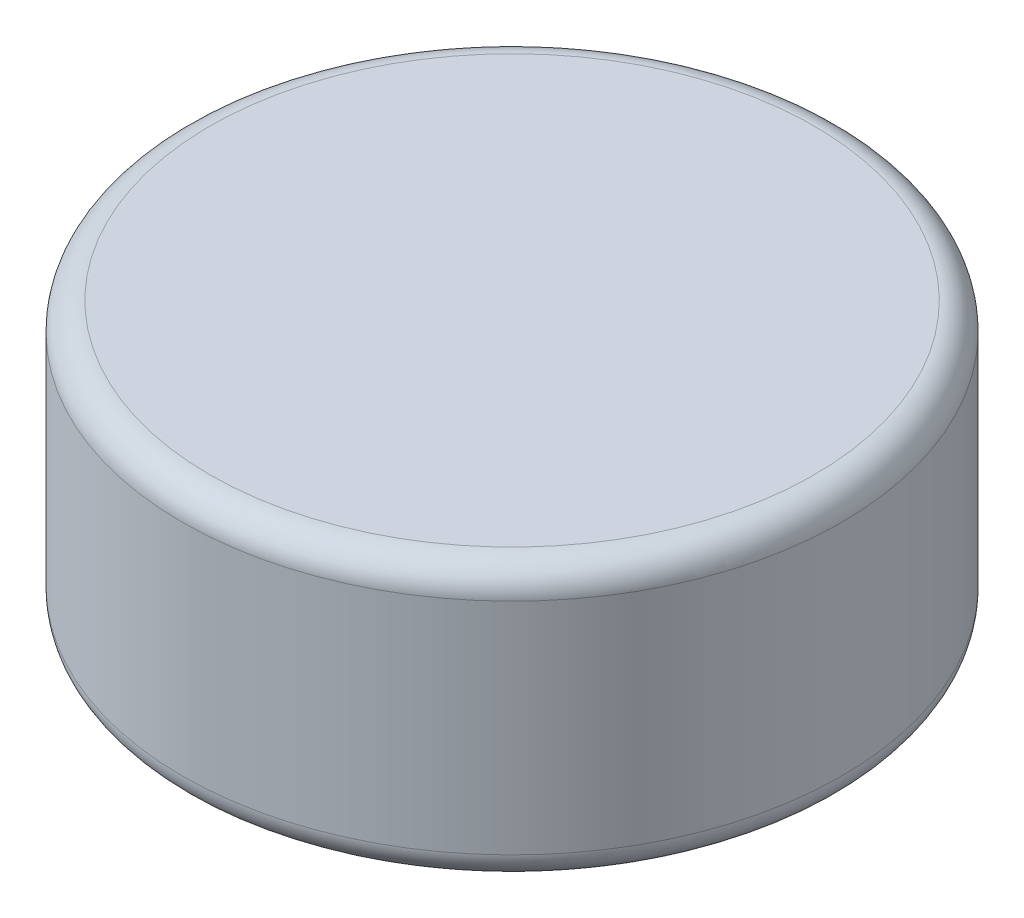
ISO-10303-21;
HEADER;
FILE_DESCRIPTION(('STEP AP214'),'2;1');
FILE_NAME('part.step','',(''),(''),'','','');
FILE_SCHEMA(('AUTOMOTIVE_DESIGN { 1 0 10303 214 1 1 1 1 }'));
ENDSEC;
DATA;
#1=APPLICATION_CONTEXT('core data for automotive mechanical design processes');
#2=APPLICATION_PROTOCOL_DEFINITION('international standard','automotive_design',2000,#1);
#3=PRODUCT_CONTEXT('',#1,'mechanical');
#4=PRODUCT('Part','Part','',(#3));
#5=PRODUCT_RELATED_PRODUCT_CATEGORY('part','',(#4));
#6=PRODUCT_DEFINITION_FORMATION('','',#4);
#7=PRODUCT_DEFINITION_CONTEXT('part definition',#1,'design');
#8=PRODUCT_DEFINITION('design','',#6,#7);
#9=PRODUCT_DEFINITION_SHAPE('','',#8);
#10=(LENGTH_UNIT() NAMED_UNIT(*) SI_UNIT(.MILLI.,.METRE.));
#11=(NAMED_UNIT(*) PLANE_ANGLE_UNIT() SI_UNIT($,.RADIAN.));
#12=(NAMED_UNIT(*) SI_UNIT($,.STERADIAN.) SOLID_ANGLE_UNIT());
#13=UNCERTAINTY_MEASURE_WITH_UNIT(LENGTH_MEASURE(1.E-05),#10,'distance_accuracy_value','');
#14=(GEOMETRIC_REPRESENTATION_CONTEXT(3) GLOBAL_UNCERTAINTY_ASSIGNED_CONTEXT((#13)) GLOBAL_UNIT_ASSIGNED_CONTEXT((#10,
#11,#12)) REPRESENTATION_CONTEXT('',''));
#15=CARTESIAN_POINT('',(0.,0.,0.));
#16=DIRECTION('',(0.,0.,1.));
#17=DIRECTION('',(1.,0.,0.));
#18=AXIS2_PLACEMENT_3D('',#15,#16,#17);
#19=CARTESIAN_POINT('',(0.,1.25,0.));
#20=DIRECTION('',(0.,-1.,0.));
#21=DIRECTION('',(0.,0.,-1.));
#22=AXIS2_PLACEMENT_3D('',#19,#20,#21);
#23=CYLINDRICAL_SURFACE('',#22,3.);
#24=CARTESIAN_POINT('',(0.,-1.,0.));
#25=DIRECTION('',(0.,1.,0.));
#26=DIRECTION('',(0.,0.,1.));
#27=AXIS2_PLACEMENT_3D('',#24,#25,#26);
#28=CIRCLE('',#27,3.);
#29=CARTESIAN_POINT('',(0.,-1.,3.));
#30=VERTEX_POINT('',#29);
#31=EDGE_CURVE('E45',#30,#30,#28,.T.);
#32=ORIENTED_EDGE('',*,*,#31,.T.);
#33=EDGE_LOOP('',(#32));
#34=FACE_BOUND('',#33,.T.);
#35=CARTESIAN_POINT('',(0.,1.,0.));
#36=DIRECTION('',(0.,1.,0.));
#37=DIRECTION('',(0.,0.,1.));
#38=AXIS2_PLACEMENT_3D('',#35,#36,#37);
#39=CIRCLE('',#38,3.);
#40=CARTESIAN_POINT('',(0.,1.,3.));
#41=VERTEX_POINT('',#40);
#42=EDGE_CURVE('E49',#41,#41,#39,.F.);
#43=ORIENTED_EDGE('',*,*,#42,.T.);
#44=EDGE_LOOP('',(#43));
#45=FACE_BOUND('',#44,.T.);
#46=ADVANCED_FACE('F34',(#34,#45),#23,.T.);
#47=CARTESIAN_POINT('',(0.,1.25,0.));
#48=DIRECTION('',(0.,1.,0.));
#49=DIRECTION('',(0.,0.,1.));
#50=AXIS2_PLACEMENT_3D('',#47,#48,#49);
#51=PLANE('',#50);
#52=CARTESIAN_POINT('',(0.,1.25,0.));
#53=DIRECTION('',(0.,1.,0.));
#54=DIRECTION('',(0.,0.,1.));
#55=AXIS2_PLACEMENT_3D('',#52,#53,#54);
#56=CIRCLE('',#55,2.75);
#57=CARTESIAN_POINT('',(0.,1.25,2.75));
#58=VERTEX_POINT('',#57);
#59=EDGE_CURVE('E10',#58,#58,#56,.T.);
#60=ORIENTED_EDGE('',*,*,#59,.T.);
#61=EDGE_LOOP('',(#60));
#62=FACE_BOUND('',#61,.T.);
#63=ADVANCED_FACE('F65',(#62),#51,.T.);
#64=CARTESIAN_POINT('',(0.,-1.25,0.));
#65=DIRECTION('',(0.,1.,0.));
#66=DIRECTION('',(0.,0.,1.));
#67=AXIS2_PLACEMENT_3D('',#64,#65,#66);
#68=PLANE('',#67);
#69=CARTESIAN_POINT('',(0.,-1.25,0.));
#70=DIRECTION('',(0.,1.,0.));
#71=DIRECTION('',(0.,0.,1.));
#72=AXIS2_PLACEMENT_3D('',#69,#70,#71);
#73=CIRCLE('',#72,2.75);
#74=CARTESIAN_POINT('',(0.,-1.25,2.75));
#75=VERTEX_POINT('',#74);
#76=EDGE_CURVE('E41',#75,#75,#73,.F.);
#77=ORIENTED_EDGE('',*,*,#76,.T.);
#78=EDGE_LOOP('',(#77));
#79=FACE_BOUND('',#78,.T.);
#80=ADVANCED_FACE('F62',(#79),#68,.F.);
#81=CARTESIAN_POINT('',(0.,-1.,0.));
#82=DIRECTION('',(0.,1.,0.));
#83=DIRECTION('',(0.,0.,1.));
#84=AXIS2_PLACEMENT_3D('',#81,#82,#83);
#85=TOROIDAL_SURFACE('',#84,2.75,0.25);
#86=ORIENTED_EDGE('',*,*,#76,.F.);
#87=EDGE_LOOP('',(#86));
#88=FACE_BOUND('',#87,.T.);
#89=ORIENTED_EDGE('',*,*,#31,.F.);
#90=EDGE_LOOP('',(#89));
#91=FACE_BOUND('',#90,.T.);
#92=ADVANCED_FACE('F58',(#88,#91),#85,.T.);
#93=CARTESIAN_POINT('',(0.,1.,0.));
#94=DIRECTION('',(0.,1.,0.));
#95=DIRECTION('',(0.,0.,1.));
#96=AXIS2_PLACEMENT_3D('',#93,#94,#95);
#97=TOROIDAL_SURFACE('',#96,2.75,0.25);
#98=ORIENTED_EDGE('',*,*,#42,.F.);
#99=EDGE_LOOP('',(#98));
#100=FACE_BOUND('',#99,.T.);
#101=ORIENTED_EDGE('',*,*,#59,.F.);
#102=EDGE_LOOP('',(#101));
#103=FACE_BOUND('',#102,.T.);
#104=ADVANCED_FACE('F36',(#100,#103),#97,.T.);
#105=CLOSED_SHELL('',(#46,#63,#80,#92,#104));
#106=MANIFOLD_SOLID_BREP('B2',#105);
#107=ADVANCED_BREP_SHAPE_REPRESENTATION('',(#18,#106),#14);
#108=SHAPE_DEFINITION_REPRESENTATION(#9,#107);
ENDSEC;
END-ISO-10303-21;
